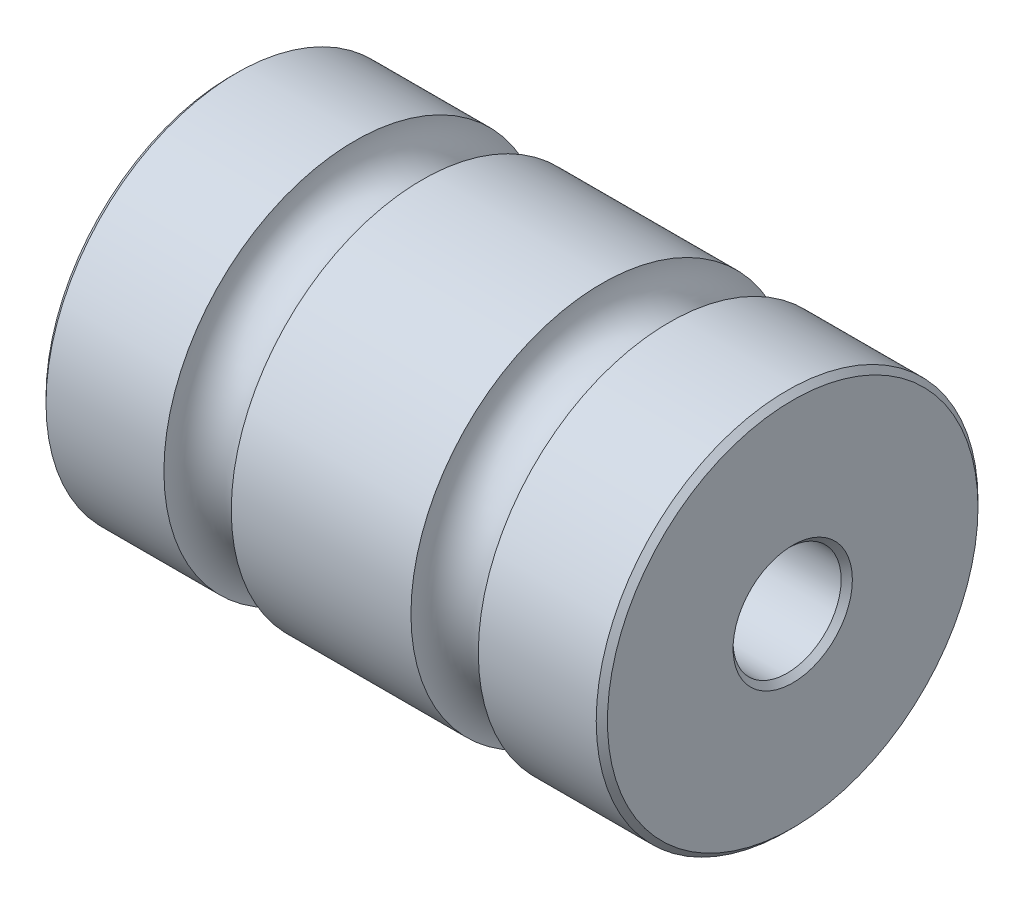
ISO-10303-21;
HEADER;
FILE_DESCRIPTION(('STEP AP214'),'2;1');
FILE_NAME('part.step','',(''),(''),'','','');
FILE_SCHEMA(('AUTOMOTIVE_DESIGN { 1 0 10303 214 1 1 1 1 }'));
ENDSEC;
DATA;
#1=APPLICATION_CONTEXT('core data for automotive mechanical design processes');
#2=APPLICATION_PROTOCOL_DEFINITION('international standard','automotive_design',2000,#1);
#3=PRODUCT_CONTEXT('',#1,'mechanical');
#4=PRODUCT('Part','Part','',(#3));
#5=PRODUCT_RELATED_PRODUCT_CATEGORY('part','',(#4));
#6=PRODUCT_DEFINITION_FORMATION('','',#4);
#7=PRODUCT_DEFINITION_CONTEXT('part definition',#1,'design');
#8=PRODUCT_DEFINITION('design','',#6,#7);
#9=PRODUCT_DEFINITION_SHAPE('','',#8);
#10=(LENGTH_UNIT() NAMED_UNIT(*) SI_UNIT(.MILLI.,.METRE.));
#11=(NAMED_UNIT(*) PLANE_ANGLE_UNIT() SI_UNIT($,.RADIAN.));
#12=(NAMED_UNIT(*) SI_UNIT($,.STERADIAN.) SOLID_ANGLE_UNIT());
#13=UNCERTAINTY_MEASURE_WITH_UNIT(LENGTH_MEASURE(1.E-05),#10,'distance_accuracy_value','');
#14=(GEOMETRIC_REPRESENTATION_CONTEXT(3) GLOBAL_UNCERTAINTY_ASSIGNED_CONTEXT((#13)) GLOBAL_UNIT_ASSIGNED_CONTEXT((#10,
#11,#12)) REPRESENTATION_CONTEXT('',''));
#15=CARTESIAN_POINT('',(0.,0.,0.));
#16=DIRECTION('',(0.,0.,1.));
#17=DIRECTION('',(1.,0.,0.));
#18=AXIS2_PLACEMENT_3D('',#15,#16,#17);
#19=CARTESIAN_POINT('',(25.,0.,0.));
#20=DIRECTION('',(1.,0.,0.));
#21=DIRECTION('',(0.,0.,-1.));
#22=AXIS2_PLACEMENT_3D('',#19,#20,#21);
#23=PLANE('',#22);
#24=CARTESIAN_POINT('',(25.,0.,0.));
#25=DIRECTION('',(1.,0.,0.));
#26=DIRECTION('',(0.,0.,-1.));
#27=AXIS2_PLACEMENT_3D('',#24,#25,#26);
#28=CIRCLE('',#27,16.5);
#29=CARTESIAN_POINT('',(25.,0.,-16.5));
#30=VERTEX_POINT('',#29);
#31=EDGE_CURVE('E10',#30,#30,#28,.T.);
#32=ORIENTED_EDGE('',*,*,#31,.T.);
#33=EDGE_LOOP('',(#32));
#34=FACE_BOUND('',#33,.T.);
#35=CARTESIAN_POINT('',(25.,0.,0.));
#36=DIRECTION('',(1.,0.,0.));
#37=DIRECTION('',(0.,0.,-1.));
#38=AXIS2_PLACEMENT_3D('',#35,#36,#37);
#39=CIRCLE('',#38,5.3125);
#40=CARTESIAN_POINT('',(25.,0.,-5.3125));
#41=VERTEX_POINT('',#40);
#42=EDGE_CURVE('E48',#41,#41,#39,.F.);
#43=ORIENTED_EDGE('',*,*,#42,.T.);
#44=EDGE_LOOP('',(#43));
#45=FACE_BOUND('',#44,.T.);
#46=ADVANCED_FACE('F39',(#34,#45),#23,.T.);
#47=CARTESIAN_POINT('',(-25.,0.,0.));
#48=DIRECTION('',(-1.,0.,0.));
#49=DIRECTION('',(0.,0.,1.));
#50=AXIS2_PLACEMENT_3D('',#47,#48,#49);
#51=CYLINDRICAL_SURFACE('',#50,17.);
#52=CARTESIAN_POINT('',(24.5,0.,0.));
#53=DIRECTION('',(1.,0.,0.));
#54=DIRECTION('',(0.,0.,-1.));
#55=AXIS2_PLACEMENT_3D('',#52,#53,#54);
#56=CIRCLE('',#55,17.);
#57=CARTESIAN_POINT('',(24.5,0.,-17.));
#58=VERTEX_POINT('',#57);
#59=EDGE_CURVE('E53',#58,#58,#56,.F.);
#60=ORIENTED_EDGE('',*,*,#59,.T.);
#61=EDGE_LOOP('',(#60));
#62=FACE_BOUND('',#61,.T.);
#63=CARTESIAN_POINT('',(14.,0.,0.));
#64=DIRECTION('',(-1.,0.,0.));
#65=DIRECTION('',(0.,0.,1.));
#66=AXIS2_PLACEMENT_3D('',#63,#64,#65);
#67=CIRCLE('',#66,17.);
#68=CARTESIAN_POINT('',(14.,0.,17.));
#69=VERTEX_POINT('',#68);
#70=EDGE_CURVE('E80',#69,#69,#67,.T.);
#71=ORIENTED_EDGE('',*,*,#70,.F.);
#72=EDGE_LOOP('',(#71));
#73=FACE_BOUND('',#72,.T.);
#74=ADVANCED_FACE('F115',(#62,#73),#51,.T.);
#75=CARTESIAN_POINT('',(11.,0.,0.));
#76=DIRECTION('',(-1.,0.,0.));
#77=DIRECTION('',(0.,0.,1.));
#78=AXIS2_PLACEMENT_3D('',#75,#76,#77);
#79=TOROIDAL_SURFACE('',#78,17.,3.);
#80=ORIENTED_EDGE('',*,*,#70,.T.);
#81=EDGE_LOOP('',(#80));
#82=FACE_BOUND('',#81,.T.);
#83=CARTESIAN_POINT('',(8.,0.,0.));
#84=DIRECTION('',(-1.,0.,0.));
#85=DIRECTION('',(0.,0.,1.));
#86=AXIS2_PLACEMENT_3D('',#83,#84,#85);
#87=CIRCLE('',#86,17.);
#88=CARTESIAN_POINT('',(8.,0.,17.));
#89=VERTEX_POINT('',#88);
#90=EDGE_CURVE('E84',#89,#89,#87,.T.);
#91=ORIENTED_EDGE('',*,*,#90,.F.);
#92=EDGE_LOOP('',(#91));
#93=FACE_BOUND('',#92,.T.);
#94=ADVANCED_FACE('F111',(#82,#93),#79,.F.);
#95=CARTESIAN_POINT('',(-25.,0.,0.));
#96=DIRECTION('',(-1.,0.,0.));
#97=DIRECTION('',(0.,0.,1.));
#98=AXIS2_PLACEMENT_3D('',#95,#96,#97);
#99=CYLINDRICAL_SURFACE('',#98,17.);
#100=ORIENTED_EDGE('',*,*,#90,.T.);
#101=EDGE_LOOP('',(#100));
#102=FACE_BOUND('',#101,.T.);
#103=CARTESIAN_POINT('',(-8.,0.,0.));
#104=DIRECTION('',(-1.,0.,0.));
#105=DIRECTION('',(0.,0.,1.));
#106=AXIS2_PLACEMENT_3D('',#103,#104,#105);
#107=CIRCLE('',#106,17.);
#108=CARTESIAN_POINT('',(-8.,0.,17.));
#109=VERTEX_POINT('',#108);
#110=EDGE_CURVE('E88',#109,#109,#107,.T.);
#111=ORIENTED_EDGE('',*,*,#110,.F.);
#112=EDGE_LOOP('',(#111));
#113=FACE_BOUND('',#112,.T.);
#114=ADVANCED_FACE('F101',(#102,#113),#99,.T.);
#115=CARTESIAN_POINT('',(-11.,0.,0.));
#116=DIRECTION('',(-1.,0.,0.));
#117=DIRECTION('',(0.,0.,1.));
#118=AXIS2_PLACEMENT_3D('',#115,#116,#117);
#119=TOROIDAL_SURFACE('',#118,17.,3.);
#120=ORIENTED_EDGE('',*,*,#110,.T.);
#121=EDGE_LOOP('',(#120));
#122=FACE_BOUND('',#121,.T.);
#123=CARTESIAN_POINT('',(-14.,0.,0.));
#124=DIRECTION('',(-1.,0.,0.));
#125=DIRECTION('',(0.,0.,1.));
#126=AXIS2_PLACEMENT_3D('',#123,#124,#125);
#127=CIRCLE('',#126,17.);
#128=CARTESIAN_POINT('',(-14.,0.,17.));
#129=VERTEX_POINT('',#128);
#130=EDGE_CURVE('E92',#129,#129,#127,.T.);
#131=ORIENTED_EDGE('',*,*,#130,.F.);
#132=EDGE_LOOP('',(#131));
#133=FACE_BOUND('',#132,.T.);
#134=ADVANCED_FACE('F99',(#122,#133),#119,.F.);
#135=CARTESIAN_POINT('',(-25.,0.,0.));
#136=DIRECTION('',(-1.,0.,0.));
#137=DIRECTION('',(0.,0.,1.));
#138=AXIS2_PLACEMENT_3D('',#135,#136,#137);
#139=CYLINDRICAL_SURFACE('',#138,17.);
#140=CARTESIAN_POINT('',(-24.5,0.,0.));
#141=DIRECTION('',(-1.,0.,0.));
#142=DIRECTION('',(0.,0.,1.));
#143=AXIS2_PLACEMENT_3D('',#140,#141,#142);
#144=CIRCLE('',#143,17.);
#145=CARTESIAN_POINT('',(-24.5,0.,17.));
#146=VERTEX_POINT('',#145);
#147=EDGE_CURVE('E68',#146,#146,#144,.F.);
#148=ORIENTED_EDGE('',*,*,#147,.T.);
#149=EDGE_LOOP('',(#148));
#150=FACE_BOUND('',#149,.T.);
#151=ORIENTED_EDGE('',*,*,#130,.T.);
#152=EDGE_LOOP('',(#151));
#153=FACE_BOUND('',#152,.T.);
#154=ADVANCED_FACE('F97',(#150,#153),#139,.T.);
#155=CARTESIAN_POINT('',(-25.,0.,0.));
#156=DIRECTION('',(-1.,0.,0.));
#157=DIRECTION('',(0.,0.,1.));
#158=AXIS2_PLACEMENT_3D('',#155,#156,#157);
#159=PLANE('',#158);
#160=CARTESIAN_POINT('',(-25.,0.,0.));
#161=DIRECTION('',(-1.,0.,0.));
#162=DIRECTION('',(0.,0.,1.));
#163=AXIS2_PLACEMENT_3D('',#160,#161,#162);
#164=CIRCLE('',#163,16.5);
#165=CARTESIAN_POINT('',(-25.,0.,16.5));
#166=VERTEX_POINT('',#165);
#167=EDGE_CURVE('E72',#166,#166,#164,.T.);
#168=ORIENTED_EDGE('',*,*,#167,.T.);
#169=EDGE_LOOP('',(#168));
#170=FACE_BOUND('',#169,.T.);
#171=CARTESIAN_POINT('',(-25.,0.,0.));
#172=DIRECTION('',(-1.,0.,0.));
#173=DIRECTION('',(0.,0.,1.));
#174=AXIS2_PLACEMENT_3D('',#171,#172,#173);
#175=CIRCLE('',#174,5.3125);
#176=CARTESIAN_POINT('',(-25.,0.,5.3125));
#177=VERTEX_POINT('',#176);
#178=EDGE_CURVE('E76',#177,#177,#175,.F.);
#179=ORIENTED_EDGE('',*,*,#178,.T.);
#180=EDGE_LOOP('',(#179));
#181=FACE_BOUND('',#180,.T.);
#182=ADVANCED_FACE('F108',(#170,#181),#159,.T.);
#183=CARTESIAN_POINT('',(-25.,0.,0.));
#184=DIRECTION('',(1.,0.,0.));
#185=DIRECTION('',(0.,0.,-1.));
#186=AXIS2_PLACEMENT_3D('',#183,#184,#185);
#187=CYLINDRICAL_SURFACE('',#186,4.8125);
#188=CARTESIAN_POINT('',(-24.5,0.,0.));
#189=DIRECTION('',(-1.,0.,0.));
#190=DIRECTION('',(0.,0.,1.));
#191=AXIS2_PLACEMENT_3D('',#188,#189,#190);
#192=CIRCLE('',#191,4.8125);
#193=CARTESIAN_POINT('',(-24.5,0.,4.8125));
#194=VERTEX_POINT('',#193);
#195=EDGE_CURVE('E58',#194,#194,#192,.T.);
#196=ORIENTED_EDGE('',*,*,#195,.T.);
#197=EDGE_LOOP('',(#196));
#198=FACE_BOUND('',#197,.T.);
#199=CARTESIAN_POINT('',(24.5,0.,0.));
#200=DIRECTION('',(1.,0.,0.));
#201=DIRECTION('',(0.,0.,-1.));
#202=AXIS2_PLACEMENT_3D('',#199,#200,#201);
#203=CIRCLE('',#202,4.8125);
#204=CARTESIAN_POINT('',(24.5,0.,-4.8125));
#205=VERTEX_POINT('',#204);
#206=EDGE_CURVE('E64',#205,#205,#203,.T.);
#207=ORIENTED_EDGE('',*,*,#206,.T.);
#208=EDGE_LOOP('',(#207));
#209=FACE_BOUND('',#208,.T.);
#210=ADVANCED_FACE('F132',(#198,#209),#187,.F.);
#211=CARTESIAN_POINT('',(-25.,0.,0.));
#212=DIRECTION('',(1.,0.,0.));
#213=DIRECTION('',(0.,0.,-1.));
#214=AXIS2_PLACEMENT_3D('',#211,#212,#213);
#215=CONICAL_SURFACE('',#214,16.5,0.785398163397438);
#216=ORIENTED_EDGE('',*,*,#147,.F.);
#217=EDGE_LOOP('',(#216));
#218=FACE_BOUND('',#217,.T.);
#219=ORIENTED_EDGE('',*,*,#167,.F.);
#220=EDGE_LOOP('',(#219));
#221=FACE_BOUND('',#220,.T.);
#222=ADVANCED_FACE('F125',(#218,#221),#215,.T.);
#223=CARTESIAN_POINT('',(-25.,0.,0.));
#224=DIRECTION('',(-1.,0.,0.));
#225=DIRECTION('',(0.,0.,1.));
#226=AXIS2_PLACEMENT_3D('',#223,#224,#225);
#227=CONICAL_SURFACE('',#226,5.3125,0.785398163397453);
#228=ORIENTED_EDGE('',*,*,#195,.F.);
#229=EDGE_LOOP('',(#228));
#230=FACE_BOUND('',#229,.T.);
#231=ORIENTED_EDGE('',*,*,#178,.F.);
#232=EDGE_LOOP('',(#231));
#233=FACE_BOUND('',#232,.T.);
#234=ADVANCED_FACE('F131',(#230,#233),#227,.F.);
#235=CARTESIAN_POINT('',(24.5,0.,0.));
#236=DIRECTION('',(-1.,0.,0.));
#237=DIRECTION('',(0.,0.,1.));
#238=AXIS2_PLACEMENT_3D('',#235,#236,#237);
#239=CONICAL_SURFACE('',#238,17.,0.785398163397455);
#240=ORIENTED_EDGE('',*,*,#31,.F.);
#241=EDGE_LOOP('',(#240));
#242=FACE_BOUND('',#241,.T.);
#243=ORIENTED_EDGE('',*,*,#59,.F.);
#244=EDGE_LOOP('',(#243));
#245=FACE_BOUND('',#244,.T.);
#246=ADVANCED_FACE('F138',(#242,#245),#239,.T.);
#247=CARTESIAN_POINT('',(24.5,0.,0.));
#248=DIRECTION('',(1.,0.,0.));
#249=DIRECTION('',(0.,0.,-1.));
#250=AXIS2_PLACEMENT_3D('',#247,#248,#249);
#251=CONICAL_SURFACE('',#250,4.8125,0.785398163397453);
#252=ORIENTED_EDGE('',*,*,#42,.F.);
#253=EDGE_LOOP('',(#252));
#254=FACE_BOUND('',#253,.T.);
#255=ORIENTED_EDGE('',*,*,#206,.F.);
#256=EDGE_LOOP('',(#255));
#257=FACE_BOUND('',#256,.T.);
#258=ADVANCED_FACE('F42',(#254,#257),#251,.F.);
#259=CLOSED_SHELL('',(#46,#74,#94,#114,#134,#154,#182,#210,#222,#234,#246,#258));
#260=MANIFOLD_SOLID_BREP('B2',#259);
#261=ADVANCED_BREP_SHAPE_REPRESENTATION('',(#18,#260),#14);
#262=SHAPE_DEFINITION_REPRESENTATION(#9,#261);
ENDSEC;
END-ISO-10303-21;
